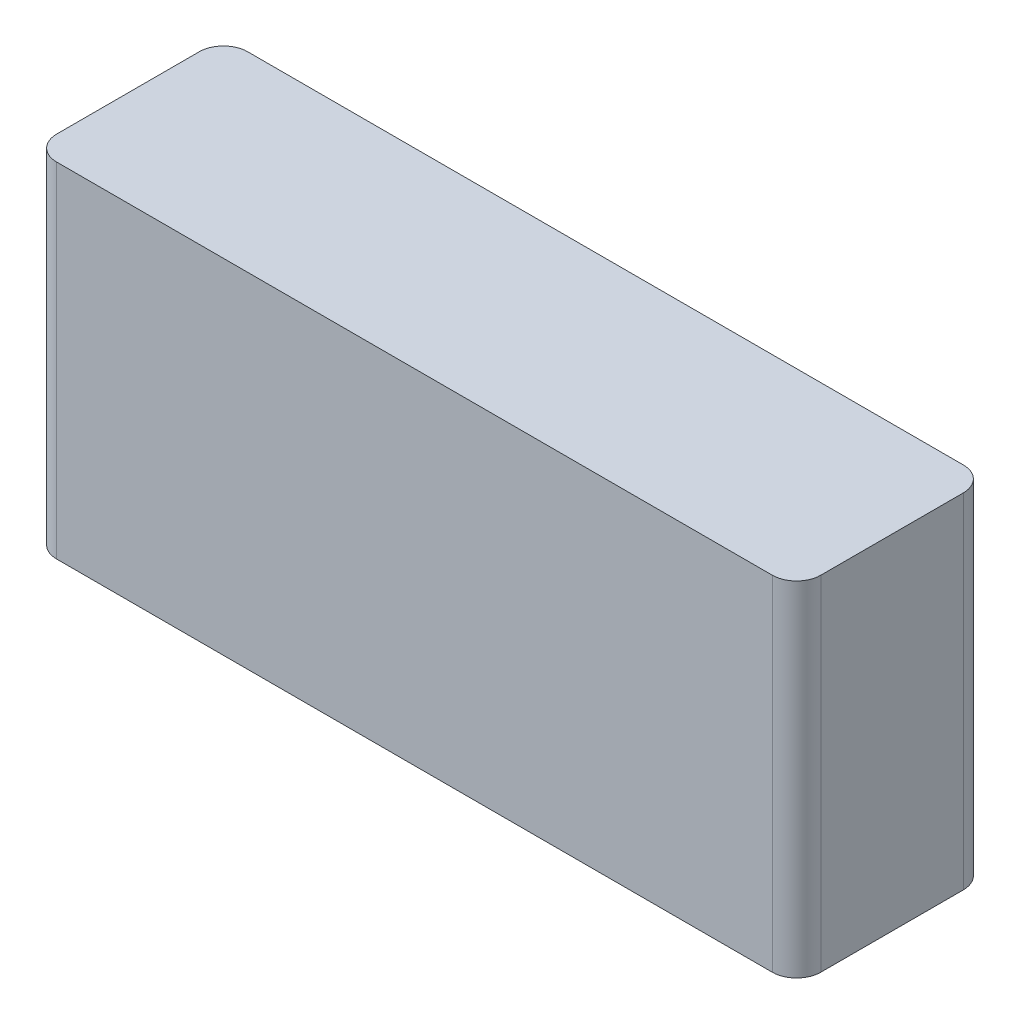
ISO-10303-21;
HEADER;
FILE_DESCRIPTION(('STEP AP214'),'2;1');
FILE_NAME('part.step','',(''),(''),'','','');
FILE_SCHEMA(('AUTOMOTIVE_DESIGN { 1 0 10303 214 1 1 1 1 }'));
ENDSEC;
DATA;
#1=APPLICATION_CONTEXT('core data for automotive mechanical design processes');
#2=APPLICATION_PROTOCOL_DEFINITION('international standard','automotive_design',2000,#1);
#3=PRODUCT_CONTEXT('',#1,'mechanical');
#4=PRODUCT('Part','Part','',(#3));
#5=PRODUCT_RELATED_PRODUCT_CATEGORY('part','',(#4));
#6=PRODUCT_DEFINITION_FORMATION('','',#4);
#7=PRODUCT_DEFINITION_CONTEXT('part definition',#1,'design');
#8=PRODUCT_DEFINITION('design','',#6,#7);
#9=PRODUCT_DEFINITION_SHAPE('','',#8);
#10=(LENGTH_UNIT() NAMED_UNIT(*) SI_UNIT(.MILLI.,.METRE.));
#11=(NAMED_UNIT(*) PLANE_ANGLE_UNIT() SI_UNIT($,.RADIAN.));
#12=(NAMED_UNIT(*) SI_UNIT($,.STERADIAN.) SOLID_ANGLE_UNIT());
#13=UNCERTAINTY_MEASURE_WITH_UNIT(LENGTH_MEASURE(1.E-05),#10,'distance_accuracy_value','');
#14=(GEOMETRIC_REPRESENTATION_CONTEXT(3) GLOBAL_UNCERTAINTY_ASSIGNED_CONTEXT((#13)) GLOBAL_UNIT_ASSIGNED_CONTEXT((#10,
#11,#12)) REPRESENTATION_CONTEXT('',''));
#15=CARTESIAN_POINT('',(0.,0.,0.));
#16=DIRECTION('',(0.,0.,1.));
#17=DIRECTION('',(1.,0.,0.));
#18=AXIS2_PLACEMENT_3D('',#15,#16,#17);
#19=CARTESIAN_POINT('',(37.46,36.,-7.46));
#20=DIRECTION('',(0.,-1.,0.));
#21=DIRECTION('',(0.,0.,-1.));
#22=AXIS2_PLACEMENT_3D('',#19,#20,#21);
#23=CYLINDRICAL_SURFACE('',#22,2.54);
#24=CARTESIAN_POINT('',(37.46,0.,-7.46));
#25=DIRECTION('',(0.,1.,0.));
#26=DIRECTION('',(0.,0.,-1.));
#27=AXIS2_PLACEMENT_3D('',#24,#25,#26);
#28=CIRCLE('',#27,2.54);
#29=CARTESIAN_POINT('',(40.,0.,-7.46));
#30=VERTEX_POINT('',#29);
#31=CARTESIAN_POINT('',(37.46,0.,-10.));
#32=VERTEX_POINT('',#31);
#33=EDGE_CURVE('E150',#30,#32,#28,.T.);
#34=ORIENTED_EDGE('',*,*,#33,.T.);
#35=DIRECTION('',(0.,-1.,0.));
#36=VECTOR('',#35,1.);
#37=CARTESIAN_POINT('',(37.46,36.,-10.));
#38=LINE('',#37,#36);
#39=CARTESIAN_POINT('',(37.46,36.,-10.));
#40=VERTEX_POINT('',#39);
#41=EDGE_CURVE('E11',#40,#32,#38,.T.);
#42=ORIENTED_EDGE('',*,*,#41,.F.);
#43=CARTESIAN_POINT('',(37.46,36.,-7.46));
#44=DIRECTION('',(0.,1.,0.));
#45=DIRECTION('',(0.,0.,-1.));
#46=AXIS2_PLACEMENT_3D('',#43,#44,#45);
#47=CIRCLE('',#46,2.54);
#48=CARTESIAN_POINT('',(40.,36.,-7.46));
#49=VERTEX_POINT('',#48);
#50=EDGE_CURVE('E172',#49,#40,#47,.T.);
#51=ORIENTED_EDGE('',*,*,#50,.F.);
#52=DIRECTION('',(0.,-1.,0.));
#53=VECTOR('',#52,1.);
#54=CARTESIAN_POINT('',(40.,36.,-7.46));
#55=LINE('',#54,#53);
#56=EDGE_CURVE('E146',#49,#30,#55,.T.);
#57=ORIENTED_EDGE('',*,*,#56,.T.);
#58=EDGE_LOOP('',(#34,#42,#51,#57));
#59=FACE_BOUND('',#58,.T.);
#60=ADVANCED_FACE('F47',(#59),#23,.T.);
#61=CARTESIAN_POINT('',(-37.46,36.,-10.));
#62=DIRECTION('',(0.,0.,1.));
#63=DIRECTION('',(1.,0.,0.));
#64=AXIS2_PLACEMENT_3D('',#61,#62,#63);
#65=PLANE('',#64);
#66=DIRECTION('',(-1.,0.,0.));
#67=VECTOR('',#66,1.);
#68=CARTESIAN_POINT('',(-37.46,0.,-10.));
#69=LINE('',#68,#67);
#70=CARTESIAN_POINT('',(-37.46,0.,-10.));
#71=VERTEX_POINT('',#70);
#72=EDGE_CURVE('E154',#32,#71,#69,.T.);
#73=ORIENTED_EDGE('',*,*,#72,.T.);
#74=DIRECTION('',(0.,-1.,0.));
#75=VECTOR('',#74,1.);
#76=CARTESIAN_POINT('',(-37.46,36.,-10.));
#77=LINE('',#76,#75);
#78=CARTESIAN_POINT('',(-37.46,36.,-10.));
#79=VERTEX_POINT('',#78);
#80=EDGE_CURVE('E56',#79,#71,#77,.T.);
#81=ORIENTED_EDGE('',*,*,#80,.F.);
#82=DIRECTION('',(-1.,0.,0.));
#83=VECTOR('',#82,1.);
#84=CARTESIAN_POINT('',(-37.46,36.,-10.));
#85=LINE('',#84,#83);
#86=EDGE_CURVE('E107',#40,#79,#85,.T.);
#87=ORIENTED_EDGE('',*,*,#86,.F.);
#88=ORIENTED_EDGE('',*,*,#41,.T.);
#89=EDGE_LOOP('',(#73,#81,#87,#88));
#90=FACE_BOUND('',#89,.T.);
#91=ADVANCED_FACE('F224',(#90),#65,.F.);
#92=CARTESIAN_POINT('',(-37.46,36.,-7.46));
#93=DIRECTION('',(0.,-1.,0.));
#94=DIRECTION('',(0.,0.,-1.));
#95=AXIS2_PLACEMENT_3D('',#92,#93,#94);
#96=CYLINDRICAL_SURFACE('',#95,2.54);
#97=CARTESIAN_POINT('',(-37.46,0.,-7.46));
#98=DIRECTION('',(0.,1.,0.));
#99=DIRECTION('',(0.,0.,1.));
#100=AXIS2_PLACEMENT_3D('',#97,#98,#99);
#101=CIRCLE('',#100,2.54);
#102=CARTESIAN_POINT('',(-40.,0.,-7.46));
#103=VERTEX_POINT('',#102);
#104=EDGE_CURVE('E157',#71,#103,#101,.T.);
#105=ORIENTED_EDGE('',*,*,#104,.T.);
#106=DIRECTION('',(0.,-1.,0.));
#107=VECTOR('',#106,1.);
#108=CARTESIAN_POINT('',(-40.,36.,-7.46));
#109=LINE('',#108,#107);
#110=CARTESIAN_POINT('',(-40.,36.,-7.46));
#111=VERTEX_POINT('',#110);
#112=EDGE_CURVE('E183',#111,#103,#109,.T.);
#113=ORIENTED_EDGE('',*,*,#112,.F.);
#114=CARTESIAN_POINT('',(-37.46,36.,-7.46));
#115=DIRECTION('',(0.,1.,0.));
#116=DIRECTION('',(0.,0.,1.));
#117=AXIS2_PLACEMENT_3D('',#114,#115,#116);
#118=CIRCLE('',#117,2.54);
#119=EDGE_CURVE('E195',#79,#111,#118,.T.);
#120=ORIENTED_EDGE('',*,*,#119,.F.);
#121=ORIENTED_EDGE('',*,*,#80,.T.);
#122=EDGE_LOOP('',(#105,#113,#120,#121));
#123=FACE_BOUND('',#122,.T.);
#124=ADVANCED_FACE('F193',(#123),#96,.T.);
#125=CARTESIAN_POINT('',(-40.,36.,-7.46));
#126=DIRECTION('',(1.,0.,0.));
#127=DIRECTION('',(0.,0.,-1.));
#128=AXIS2_PLACEMENT_3D('',#125,#126,#127);
#129=PLANE('',#128);
#130=DIRECTION('',(0.,0.,1.));
#131=VECTOR('',#130,1.);
#132=CARTESIAN_POINT('',(-40.,0.,-7.46));
#133=LINE('',#132,#131);
#134=CARTESIAN_POINT('',(-40.,0.,7.46));
#135=VERTEX_POINT('',#134);
#136=EDGE_CURVE('E160',#103,#135,#133,.T.);
#137=ORIENTED_EDGE('',*,*,#136,.T.);
#138=DIRECTION('',(0.,-1.,0.));
#139=VECTOR('',#138,1.);
#140=CARTESIAN_POINT('',(-40.,36.,7.46));
#141=LINE('',#140,#139);
#142=CARTESIAN_POINT('',(-40.,36.,7.46));
#143=VERTEX_POINT('',#142);
#144=EDGE_CURVE('E179',#143,#135,#141,.T.);
#145=ORIENTED_EDGE('',*,*,#144,.F.);
#146=DIRECTION('',(0.,0.,1.));
#147=VECTOR('',#146,1.);
#148=CARTESIAN_POINT('',(-40.,36.,-7.46));
#149=LINE('',#148,#147);
#150=EDGE_CURVE('E208',#111,#143,#149,.T.);
#151=ORIENTED_EDGE('',*,*,#150,.F.);
#152=ORIENTED_EDGE('',*,*,#112,.T.);
#153=EDGE_LOOP('',(#137,#145,#151,#152));
#154=FACE_BOUND('',#153,.T.);
#155=ADVANCED_FACE('F203',(#154),#129,.F.);
#156=CARTESIAN_POINT('',(-37.46,36.,7.46));
#157=DIRECTION('',(0.,-1.,0.));
#158=DIRECTION('',(0.,0.,-1.));
#159=AXIS2_PLACEMENT_3D('',#156,#157,#158);
#160=CYLINDRICAL_SURFACE('',#159,2.54);
#161=CARTESIAN_POINT('',(-37.46,0.,7.46));
#162=DIRECTION('',(0.,1.,0.));
#163=DIRECTION('',(0.,0.,1.));
#164=AXIS2_PLACEMENT_3D('',#161,#162,#163);
#165=CIRCLE('',#164,2.54);
#166=CARTESIAN_POINT('',(-37.46,0.,10.));
#167=VERTEX_POINT('',#166);
#168=EDGE_CURVE('E163',#135,#167,#165,.T.);
#169=ORIENTED_EDGE('',*,*,#168,.T.);
#170=DIRECTION('',(0.,-1.,0.));
#171=VECTOR('',#170,1.);
#172=CARTESIAN_POINT('',(-37.46,36.,10.));
#173=LINE('',#172,#171);
#174=CARTESIAN_POINT('',(-37.46,36.,10.));
#175=VERTEX_POINT('',#174);
#176=EDGE_CURVE('E137',#175,#167,#173,.T.);
#177=ORIENTED_EDGE('',*,*,#176,.F.);
#178=CARTESIAN_POINT('',(-37.46,36.,7.46));
#179=DIRECTION('',(0.,1.,0.));
#180=DIRECTION('',(0.,0.,1.));
#181=AXIS2_PLACEMENT_3D('',#178,#179,#180);
#182=CIRCLE('',#181,2.54);
#183=EDGE_CURVE('E126',#143,#175,#182,.T.);
#184=ORIENTED_EDGE('',*,*,#183,.F.);
#185=ORIENTED_EDGE('',*,*,#144,.T.);
#186=EDGE_LOOP('',(#169,#177,#184,#185));
#187=FACE_BOUND('',#186,.T.);
#188=ADVANCED_FACE('F206',(#187),#160,.T.);
#189=CARTESIAN_POINT('',(-37.46,36.,10.));
#190=DIRECTION('',(0.,0.,-1.));
#191=DIRECTION('',(-1.,0.,0.));
#192=AXIS2_PLACEMENT_3D('',#189,#190,#191);
#193=PLANE('',#192);
#194=DIRECTION('',(1.,0.,0.));
#195=VECTOR('',#194,1.);
#196=CARTESIAN_POINT('',(-37.46,0.,10.));
#197=LINE('',#196,#195);
#198=CARTESIAN_POINT('',(37.46,0.,10.));
#199=VERTEX_POINT('',#198);
#200=EDGE_CURVE('E135',#167,#199,#197,.T.);
#201=ORIENTED_EDGE('',*,*,#200,.T.);
#202=DIRECTION('',(0.,-1.,0.));
#203=VECTOR('',#202,1.);
#204=CARTESIAN_POINT('',(37.46,36.,10.));
#205=LINE('',#204,#203);
#206=CARTESIAN_POINT('',(37.46,36.,10.));
#207=VERTEX_POINT('',#206);
#208=EDGE_CURVE('E132',#207,#199,#205,.T.);
#209=ORIENTED_EDGE('',*,*,#208,.F.);
#210=DIRECTION('',(1.,0.,0.));
#211=VECTOR('',#210,1.);
#212=CARTESIAN_POINT('',(-37.46,36.,10.));
#213=LINE('',#212,#211);
#214=EDGE_CURVE('E120',#175,#207,#213,.T.);
#215=ORIENTED_EDGE('',*,*,#214,.F.);
#216=ORIENTED_EDGE('',*,*,#176,.T.);
#217=EDGE_LOOP('',(#201,#209,#215,#216));
#218=FACE_BOUND('',#217,.T.);
#219=ADVANCED_FACE('F133',(#218),#193,.F.);
#220=CARTESIAN_POINT('',(37.46,36.,7.46));
#221=DIRECTION('',(0.,-1.,0.));
#222=DIRECTION('',(0.,0.,-1.));
#223=AXIS2_PLACEMENT_3D('',#220,#221,#222);
#224=CYLINDRICAL_SURFACE('',#223,2.54000000000001);
#225=CARTESIAN_POINT('',(37.46,0.,7.46));
#226=DIRECTION('',(0.,1.,0.));
#227=DIRECTION('',(0.,0.,1.));
#228=AXIS2_PLACEMENT_3D('',#225,#226,#227);
#229=CIRCLE('',#228,2.54000000000001);
#230=CARTESIAN_POINT('',(40.,0.,7.46));
#231=VERTEX_POINT('',#230);
#232=EDGE_CURVE('E93',#199,#231,#229,.T.);
#233=ORIENTED_EDGE('',*,*,#232,.T.);
#234=DIRECTION('',(0.,-1.,0.));
#235=VECTOR('',#234,1.);
#236=CARTESIAN_POINT('',(40.,36.,7.46));
#237=LINE('',#236,#235);
#238=CARTESIAN_POINT('',(40.,36.,7.46));
#239=VERTEX_POINT('',#238);
#240=EDGE_CURVE('E138',#239,#231,#237,.T.);
#241=ORIENTED_EDGE('',*,*,#240,.F.);
#242=CARTESIAN_POINT('',(37.46,36.,7.46));
#243=DIRECTION('',(0.,1.,0.));
#244=DIRECTION('',(0.,0.,1.));
#245=AXIS2_PLACEMENT_3D('',#242,#243,#244);
#246=CIRCLE('',#245,2.54000000000001);
#247=EDGE_CURVE('E124',#207,#239,#246,.T.);
#248=ORIENTED_EDGE('',*,*,#247,.F.);
#249=ORIENTED_EDGE('',*,*,#208,.T.);
#250=EDGE_LOOP('',(#233,#241,#248,#249));
#251=FACE_BOUND('',#250,.T.);
#252=ADVANCED_FACE('F140',(#251),#224,.T.);
#253=CARTESIAN_POINT('',(40.,36.,-7.46));
#254=DIRECTION('',(-1.,0.,0.));
#255=DIRECTION('',(0.,0.,1.));
#256=AXIS2_PLACEMENT_3D('',#253,#254,#255);
#257=PLANE('',#256);
#258=DIRECTION('',(0.,0.,-1.));
#259=VECTOR('',#258,1.);
#260=CARTESIAN_POINT('',(40.,0.,-7.46));
#261=LINE('',#260,#259);
#262=EDGE_CURVE('E99',#231,#30,#261,.T.);
#263=ORIENTED_EDGE('',*,*,#262,.T.);
#264=ORIENTED_EDGE('',*,*,#56,.F.);
#265=DIRECTION('',(0.,0.,-1.));
#266=VECTOR('',#265,1.);
#267=CARTESIAN_POINT('',(40.,36.,-7.46));
#268=LINE('',#267,#266);
#269=EDGE_CURVE('E64',#239,#49,#268,.T.);
#270=ORIENTED_EDGE('',*,*,#269,.F.);
#271=ORIENTED_EDGE('',*,*,#240,.T.);
#272=EDGE_LOOP('',(#263,#264,#270,#271));
#273=FACE_BOUND('',#272,.T.);
#274=ADVANCED_FACE('F240',(#273),#257,.F.);
#275=CARTESIAN_POINT('',(37.46,36.,-7.46));
#276=DIRECTION('',(0.,-1.,0.));
#277=DIRECTION('',(0.,0.,-1.));
#278=AXIS2_PLACEMENT_3D('',#275,#276,#277);
#279=PLANE('',#278);
#280=ORIENTED_EDGE('',*,*,#50,.T.);
#281=ORIENTED_EDGE('',*,*,#86,.T.);
#282=ORIENTED_EDGE('',*,*,#119,.T.);
#283=ORIENTED_EDGE('',*,*,#150,.T.);
#284=ORIENTED_EDGE('',*,*,#183,.T.);
#285=ORIENTED_EDGE('',*,*,#214,.T.);
#286=ORIENTED_EDGE('',*,*,#247,.T.);
#287=ORIENTED_EDGE('',*,*,#269,.T.);
#288=EDGE_LOOP('',(#280,#281,#282,#283,#284,#285,#286,#287));
#289=FACE_BOUND('',#288,.T.);
#290=ADVANCED_FACE('F122',(#289),#279,.F.);
#291=CARTESIAN_POINT('',(37.46,0.,-7.46));
#292=DIRECTION('',(0.,-1.,0.));
#293=DIRECTION('',(0.,0.,-1.));
#294=AXIS2_PLACEMENT_3D('',#291,#292,#293);
#295=PLANE('',#294);
#296=ORIENTED_EDGE('',*,*,#33,.F.);
#297=ORIENTED_EDGE('',*,*,#262,.F.);
#298=ORIENTED_EDGE('',*,*,#232,.F.);
#299=ORIENTED_EDGE('',*,*,#200,.F.);
#300=ORIENTED_EDGE('',*,*,#168,.F.);
#301=ORIENTED_EDGE('',*,*,#136,.F.);
#302=ORIENTED_EDGE('',*,*,#104,.F.);
#303=ORIENTED_EDGE('',*,*,#72,.F.);
#304=EDGE_LOOP('',(#296,#297,#298,#299,#300,#301,#302,#303));
#305=FACE_BOUND('',#304,.T.);
#306=ADVANCED_FACE('F199',(#305),#295,.T.);
#307=CLOSED_SHELL('',(#60,#91,#124,#155,#188,#219,#252,#274,#290,#306));
#308=MANIFOLD_SOLID_BREP('B2',#307);
#309=ADVANCED_BREP_SHAPE_REPRESENTATION('',(#18,#308),#14);
#310=SHAPE_DEFINITION_REPRESENTATION(#9,#309);
ENDSEC;
END-ISO-10303-21;
